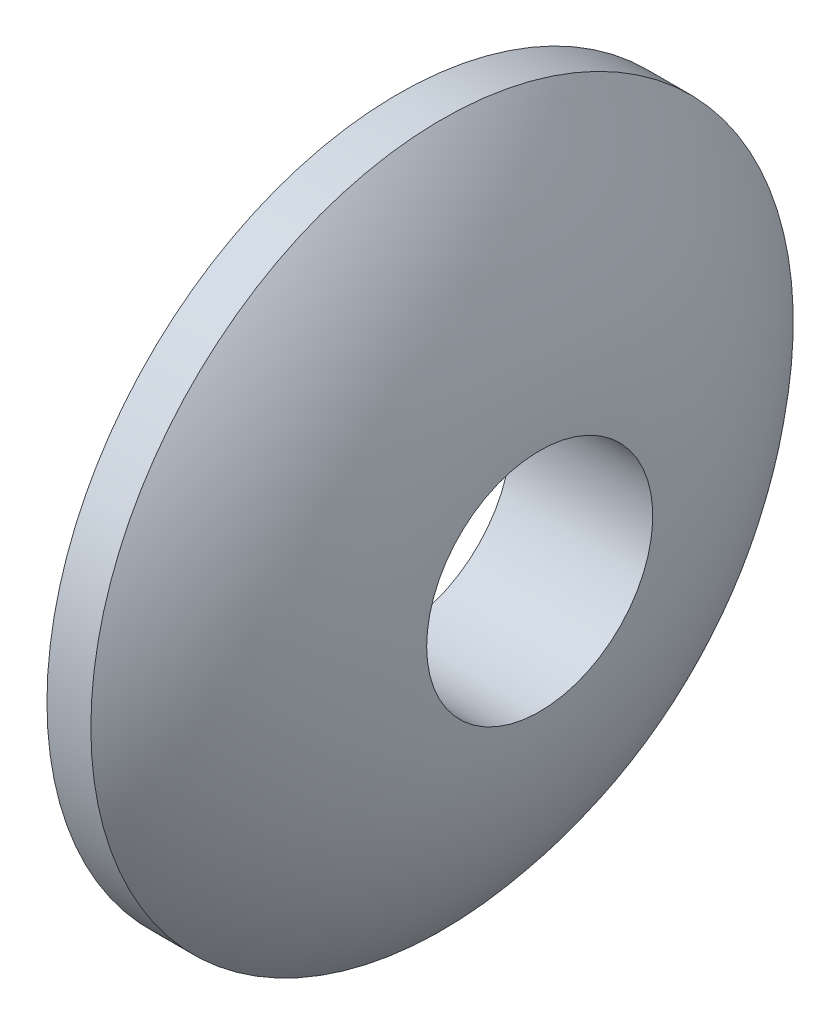
ISO-10303-21;
HEADER;
FILE_DESCRIPTION(('STEP AP214'),'2;1');
FILE_NAME('part.step','',(''),(''),'','','');
FILE_SCHEMA(('AUTOMOTIVE_DESIGN { 1 0 10303 214 1 1 1 1 }'));
ENDSEC;
DATA;
#1=APPLICATION_CONTEXT('core data for automotive mechanical design processes');
#2=APPLICATION_PROTOCOL_DEFINITION('international standard','automotive_design',2000,#1);
#3=PRODUCT_CONTEXT('',#1,'mechanical');
#4=PRODUCT('Part','Part','',(#3));
#5=PRODUCT_RELATED_PRODUCT_CATEGORY('part','',(#4));
#6=PRODUCT_DEFINITION_FORMATION('','',#4);
#7=PRODUCT_DEFINITION_CONTEXT('part definition',#1,'design');
#8=PRODUCT_DEFINITION('design','',#6,#7);
#9=PRODUCT_DEFINITION_SHAPE('','',#8);
#10=(LENGTH_UNIT() NAMED_UNIT(*) SI_UNIT(.MILLI.,.METRE.));
#11=(NAMED_UNIT(*) PLANE_ANGLE_UNIT() SI_UNIT($,.RADIAN.));
#12=(NAMED_UNIT(*) SI_UNIT($,.STERADIAN.) SOLID_ANGLE_UNIT());
#13=UNCERTAINTY_MEASURE_WITH_UNIT(LENGTH_MEASURE(1.E-05),#10,'distance_accuracy_value','');
#14=(GEOMETRIC_REPRESENTATION_CONTEXT(3) GLOBAL_UNCERTAINTY_ASSIGNED_CONTEXT((#13)) GLOBAL_UNIT_ASSIGNED_CONTEXT((#10,
#11,#12)) REPRESENTATION_CONTEXT('',''));
#15=CARTESIAN_POINT('',(0.,0.,0.));
#16=DIRECTION('',(0.,0.,1.));
#17=DIRECTION('',(1.,0.,0.));
#18=AXIS2_PLACEMENT_3D('',#15,#16,#17);
#19=CARTESIAN_POINT('',(0.,0.,0.));
#20=DIRECTION('',(1.,0.,0.));
#21=DIRECTION('',(0.,0.,-1.));
#22=AXIS2_PLACEMENT_3D('',#19,#20,#21);
#23=PLANE('',#22);
#24=CARTESIAN_POINT('',(0.,0.,0.));
#25=DIRECTION('',(-1.,0.,0.));
#26=DIRECTION('',(0.,0.,1.));
#27=AXIS2_PLACEMENT_3D('',#24,#25,#26);
#28=CIRCLE('',#27,2.575);
#29=CARTESIAN_POINT('',(0.,0.,2.575));
#30=VERTEX_POINT('',#29);
#31=EDGE_CURVE('E50',#30,#30,#28,.T.);
#32=ORIENTED_EDGE('',*,*,#31,.F.);
#33=EDGE_LOOP('',(#32));
#34=FACE_BOUND('',#33,.T.);
#35=CARTESIAN_POINT('',(0.,0.,0.));
#36=DIRECTION('',(-1.,0.,0.));
#37=DIRECTION('',(0.,0.,1.));
#38=AXIS2_PLACEMENT_3D('',#35,#36,#37);
#39=CIRCLE('',#38,8.);
#40=CARTESIAN_POINT('',(0.,0.,8.));
#41=VERTEX_POINT('',#40);
#42=EDGE_CURVE('E10',#41,#41,#39,.T.);
#43=ORIENTED_EDGE('',*,*,#42,.T.);
#44=EDGE_LOOP('',(#43));
#45=FACE_BOUND('',#44,.T.);
#46=ADVANCED_FACE('F37',(#34,#45),#23,.F.);
#47=CARTESIAN_POINT('',(-6.042194092827,0.,0.));
#48=DIRECTION('',(-1.,0.,0.));
#49=DIRECTION('',(0.,0.,1.));
#50=AXIS2_PLACEMENT_3D('',#47,#48,#49);
#51=CYLINDRICAL_SURFACE('',#50,8.);
#52=ORIENTED_EDGE('',*,*,#42,.F.);
#53=EDGE_LOOP('',(#52));
#54=FACE_BOUND('',#53,.T.);
#55=CARTESIAN_POINT('',(1.,0.,0.));
#56=DIRECTION('',(-1.,0.,0.));
#57=DIRECTION('',(0.,0.,1.));
#58=AXIS2_PLACEMENT_3D('',#55,#56,#57);
#59=CIRCLE('',#58,8.);
#60=CARTESIAN_POINT('',(1.,0.,8.));
#61=VERTEX_POINT('',#60);
#62=EDGE_CURVE('E44',#61,#61,#59,.T.);
#63=ORIENTED_EDGE('',*,*,#62,.T.);
#64=EDGE_LOOP('',(#63));
#65=FACE_BOUND('',#64,.T.);
#66=ADVANCED_FACE('F66',(#54,#65),#51,.T.);
#67=CARTESIAN_POINT('',(-5.76114000116266,0.,0.));
#68=DIRECTION('',(-1.,0.,0.));
#69=DIRECTION('',(0.,0.,1.));
#70=AXIS2_PLACEMENT_3D('',#67,#68,#69);
#71=DEGENERATE_TOROIDAL_SURFACE('',#70,2.05971499970934,9.,.T.);
#72=CARTESIAN_POINT('',(3.22409685539686,0.,0.));
#73=DIRECTION('',(-1.,0.,0.));
#74=DIRECTION('',(0.,0.,1.));
#75=AXIS2_PLACEMENT_3D('',#72,#73,#74);
#76=CIRCLE('',#75,2.575);
#77=CARTESIAN_POINT('',(3.22409685539686,0.,2.575));
#78=VERTEX_POINT('',#77);
#79=EDGE_CURVE('E40',#78,#78,#76,.T.);
#80=ORIENTED_EDGE('',*,*,#79,.T.);
#81=EDGE_LOOP('',(#80));
#82=FACE_BOUND('',#81,.T.);
#83=ORIENTED_EDGE('',*,*,#62,.F.);
#84=EDGE_LOOP('',(#83));
#85=FACE_BOUND('',#84,.T.);
#86=ADVANCED_FACE('F57',(#82,#85),#71,.T.);
#87=CARTESIAN_POINT('',(3.23885999883734,0.,0.));
#88=DIRECTION('',(-1.,0.,0.));
#89=DIRECTION('',(0.,0.,1.));
#90=AXIS2_PLACEMENT_3D('',#87,#88,#89);
#91=CYLINDRICAL_SURFACE('',#90,2.575);
#92=ORIENTED_EDGE('',*,*,#31,.T.);
#93=EDGE_LOOP('',(#92));
#94=FACE_BOUND('',#93,.T.);
#95=ORIENTED_EDGE('',*,*,#79,.F.);
#96=EDGE_LOOP('',(#95));
#97=FACE_BOUND('',#96,.T.);
#98=ADVANCED_FACE('F60',(#94,#97),#91,.F.);
#99=CLOSED_SHELL('',(#46,#66,#86,#98));
#100=MANIFOLD_SOLID_BREP('B2',#99);
#101=ADVANCED_BREP_SHAPE_REPRESENTATION('',(#18,#100),#14);
#102=SHAPE_DEFINITION_REPRESENTATION(#9,#101);
ENDSEC;
END-ISO-10303-21;
